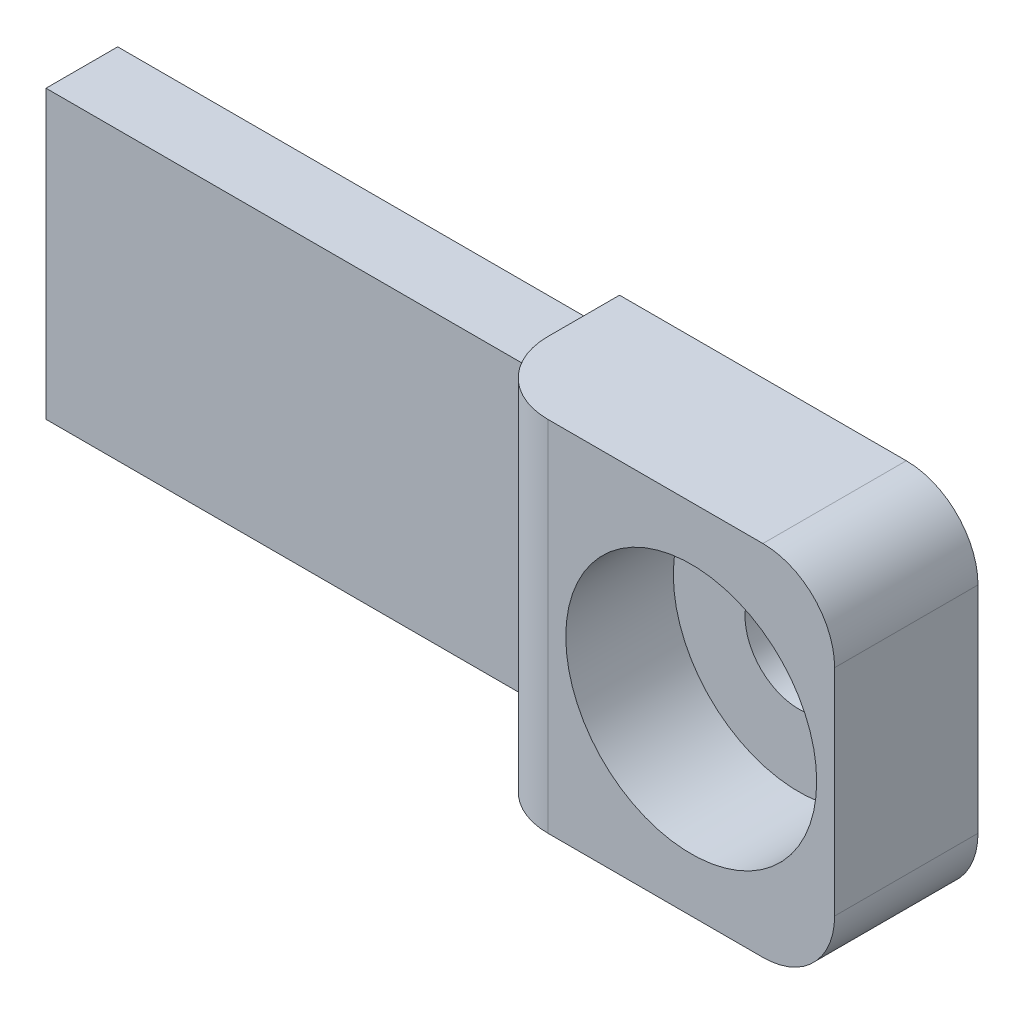
ISO-10303-21;
HEADER;
FILE_DESCRIPTION(('STEP AP214'),'2;1');
FILE_NAME('part.step','',(''),(''),'','','');
FILE_SCHEMA(('AUTOMOTIVE_DESIGN { 1 0 10303 214 1 1 1 1 }'));
ENDSEC;
DATA;
#1=APPLICATION_CONTEXT('core data for automotive mechanical design processes');
#2=APPLICATION_PROTOCOL_DEFINITION('international standard','automotive_design',2000,#1);
#3=PRODUCT_CONTEXT('',#1,'mechanical');
#4=PRODUCT('Part','Part','',(#3));
#5=PRODUCT_RELATED_PRODUCT_CATEGORY('part','',(#4));
#6=PRODUCT_DEFINITION_FORMATION('','',#4);
#7=PRODUCT_DEFINITION_CONTEXT('part definition',#1,'design');
#8=PRODUCT_DEFINITION('design','',#6,#7);
#9=PRODUCT_DEFINITION_SHAPE('','',#8);
#10=(LENGTH_UNIT() NAMED_UNIT(*) SI_UNIT(.MILLI.,.METRE.));
#11=(NAMED_UNIT(*) PLANE_ANGLE_UNIT() SI_UNIT($,.RADIAN.));
#12=(NAMED_UNIT(*) SI_UNIT($,.STERADIAN.) SOLID_ANGLE_UNIT());
#13=UNCERTAINTY_MEASURE_WITH_UNIT(LENGTH_MEASURE(1.E-05),#10,'distance_accuracy_value','');
#14=(GEOMETRIC_REPRESENTATION_CONTEXT(3) GLOBAL_UNCERTAINTY_ASSIGNED_CONTEXT((#13)) GLOBAL_UNIT_ASSIGNED_CONTEXT((#10,
#11,#12)) REPRESENTATION_CONTEXT('',''));
#15=CARTESIAN_POINT('',(0.,0.,0.));
#16=DIRECTION('',(0.,0.,1.));
#17=DIRECTION('',(1.,0.,0.));
#18=AXIS2_PLACEMENT_3D('',#15,#16,#17);
#19=CARTESIAN_POINT('',(0.,20.,20.));
#20=DIRECTION('',(1.,0.,0.));
#21=DIRECTION('',(0.,1.,0.));
#22=AXIS2_PLACEMENT_3D('',#19,#20,#21);
#23=PLANE('',#22);
#24=DIRECTION('',(0.,0.,-1.));
#25=VECTOR('',#24,1.);
#26=CARTESIAN_POINT('',(0.,-25.,20.));
#27=LINE('',#26,#25);
#28=CARTESIAN_POINT('',(0.,-25.,10.));
#29=VERTEX_POINT('',#28);
#30=CARTESIAN_POINT('',(0.,-25.,0.));
#31=VERTEX_POINT('',#30);
#32=EDGE_CURVE('E178',#29,#31,#27,.T.);
#33=ORIENTED_EDGE('',*,*,#32,.F.);
#34=DIRECTION('',(0.,-1.,0.));
#35=VECTOR('',#34,1.);
#36=CARTESIAN_POINT('',(0.,25.,10.));
#37=LINE('',#36,#35);
#38=CARTESIAN_POINT('',(0.,-20.,10.));
#39=VERTEX_POINT('',#38);
#40=EDGE_CURVE('E41',#29,#39,#37,.F.);
#41=ORIENTED_EDGE('',*,*,#40,.T.);
#42=DIRECTION('',(0.,0.,-1.));
#43=VECTOR('',#42,1.);
#44=CARTESIAN_POINT('',(0.,-20.,20.));
#45=LINE('',#44,#43);
#46=CARTESIAN_POINT('',(0.,-20.,0.));
#47=VERTEX_POINT('',#46);
#48=EDGE_CURVE('E176',#39,#47,#45,.T.);
#49=ORIENTED_EDGE('',*,*,#48,.T.);
#50=DIRECTION('',(0.,-1.,0.));
#51=VECTOR('',#50,1.);
#52=CARTESIAN_POINT('',(0.,-20.,0.));
#53=LINE('',#52,#51);
#54=EDGE_CURVE('E196',#47,#31,#53,.T.);
#55=ORIENTED_EDGE('',*,*,#54,.T.);
#56=EDGE_LOOP('',(#33,#41,#49,#55));
#57=FACE_BOUND('',#56,.T.);
#58=ADVANCED_FACE('F33',(#57),#23,.F.);
#59=CARTESIAN_POINT('',(30.,0.,-0.001000000000001));
#60=DIRECTION('',(0.,0.,1.));
#61=DIRECTION('',(1.,0.,0.));
#62=AXIS2_PLACEMENT_3D('',#59,#60,#61);
#63=CYLINDRICAL_SURFACE('',#62,7.5);
#64=CARTESIAN_POINT('',(30.,0.,0.));
#65=DIRECTION('',(0.,0.,1.));
#66=DIRECTION('',(1.,0.,0.));
#67=AXIS2_PLACEMENT_3D('',#64,#65,#66);
#68=CIRCLE('',#67,7.5);
#69=CARTESIAN_POINT('',(37.5,0.,0.));
#70=VERTEX_POINT('',#69);
#71=EDGE_CURVE('E173',#70,#70,#68,.F.);
#72=ORIENTED_EDGE('',*,*,#71,.T.);
#73=EDGE_LOOP('',(#72));
#74=FACE_BOUND('',#73,.T.);
#75=CARTESIAN_POINT('',(30.,0.,5.));
#76=DIRECTION('',(0.,0.,1.));
#77=DIRECTION('',(1.,0.,0.));
#78=AXIS2_PLACEMENT_3D('',#75,#76,#77);
#79=CIRCLE('',#78,7.5);
#80=CARTESIAN_POINT('',(37.5,0.,5.));
#81=VERTEX_POINT('',#80);
#82=EDGE_CURVE('E170',#81,#81,#79,.F.);
#83=ORIENTED_EDGE('',*,*,#82,.F.);
#84=EDGE_LOOP('',(#83));
#85=FACE_BOUND('',#84,.T.);
#86=ADVANCED_FACE('F262',(#74,#85),#63,.F.);
#87=CARTESIAN_POINT('',(-70.,20.,20.));
#88=DIRECTION('',(1.,0.,0.));
#89=DIRECTION('',(0.,1.,0.));
#90=AXIS2_PLACEMENT_3D('',#87,#88,#89);
#91=PLANE('',#90);
#92=DIRECTION('',(0.,0.,-1.));
#93=VECTOR('',#92,1.);
#94=CARTESIAN_POINT('',(-70.,-20.,20.));
#95=LINE('',#94,#93);
#96=CARTESIAN_POINT('',(-70.,-20.0000000000001,10.));
#97=VERTEX_POINT('',#96);
#98=CARTESIAN_POINT('',(-70.,-20.,0.));
#99=VERTEX_POINT('',#98);
#100=EDGE_CURVE('E169',#97,#99,#95,.T.);
#101=ORIENTED_EDGE('',*,*,#100,.F.);
#102=DIRECTION('',(0.,-1.,0.));
#103=VECTOR('',#102,1.);
#104=CARTESIAN_POINT('',(-70.,20.,10.));
#105=LINE('',#104,#103);
#106=CARTESIAN_POINT('',(-70.,20.,10.));
#107=VERTEX_POINT('',#106);
#108=EDGE_CURVE('E126',#107,#97,#105,.T.);
#109=ORIENTED_EDGE('',*,*,#108,.F.);
#110=DIRECTION('',(0.,0.,-1.));
#111=VECTOR('',#110,1.);
#112=CARTESIAN_POINT('',(-70.,20.,20.));
#113=LINE('',#112,#111);
#114=CARTESIAN_POINT('',(-70.,20.,0.));
#115=VERTEX_POINT('',#114);
#116=EDGE_CURVE('E134',#107,#115,#113,.T.);
#117=ORIENTED_EDGE('',*,*,#116,.T.);
#118=DIRECTION('',(0.,-1.,0.));
#119=VECTOR('',#118,1.);
#120=CARTESIAN_POINT('',(-70.,20.,0.));
#121=LINE('',#120,#119);
#122=EDGE_CURVE('E202',#115,#99,#121,.T.);
#123=ORIENTED_EDGE('',*,*,#122,.T.);
#124=EDGE_LOOP('',(#101,#109,#117,#123));
#125=FACE_BOUND('',#124,.T.);
#126=ADVANCED_FACE('F224',(#125),#91,.F.);
#127=CARTESIAN_POINT('',(-70.,-20.,20.));
#128=DIRECTION('',(0.,1.,0.));
#129=DIRECTION('',(-1.,0.,0.));
#130=AXIS2_PLACEMENT_3D('',#127,#128,#129);
#131=PLANE('',#130);
#132=ORIENTED_EDGE('',*,*,#48,.F.);
#133=DIRECTION('',(-1.,0.,0.));
#134=VECTOR('',#133,1.);
#135=CARTESIAN_POINT('',(0.,-20.,10.));
#136=LINE('',#135,#134);
#137=EDGE_CURVE('E122',#39,#97,#136,.T.);
#138=ORIENTED_EDGE('',*,*,#137,.T.);
#139=ORIENTED_EDGE('',*,*,#100,.T.);
#140=DIRECTION('',(1.,0.,0.));
#141=VECTOR('',#140,1.);
#142=CARTESIAN_POINT('',(-70.,-20.,0.));
#143=LINE('',#142,#141);
#144=EDGE_CURVE('E199',#99,#47,#143,.T.);
#145=ORIENTED_EDGE('',*,*,#144,.T.);
#146=EDGE_LOOP('',(#132,#138,#139,#145));
#147=FACE_BOUND('',#146,.T.);
#148=ADVANCED_FACE('F222',(#147),#131,.F.);
#149=CARTESIAN_POINT('',(0.,-25.,20.));
#150=DIRECTION('',(0.,1.,0.));
#151=DIRECTION('',(-1.,0.,0.));
#152=AXIS2_PLACEMENT_3D('',#149,#150,#151);
#153=PLANE('',#152);
#154=DIRECTION('',(1.,0.,0.));
#155=VECTOR('',#154,1.);
#156=CARTESIAN_POINT('',(0.,-25.,20.));
#157=LINE('',#156,#155);
#158=CARTESIAN_POINT('',(10.,-25.,20.));
#159=VERTEX_POINT('',#158);
#160=CARTESIAN_POINT('',(40.,-25.,20.));
#161=VERTEX_POINT('',#160);
#162=EDGE_CURVE('E185',#159,#161,#157,.T.);
#163=ORIENTED_EDGE('',*,*,#162,.F.);
#164=CARTESIAN_POINT('',(10.,-25.,10.));
#165=DIRECTION('',(0.,1.,0.));
#166=DIRECTION('',(-1.,0.,0.));
#167=AXIS2_PLACEMENT_3D('',#164,#165,#166);
#168=CIRCLE('',#167,10.);
#169=EDGE_CURVE('E56',#159,#29,#168,.F.);
#170=ORIENTED_EDGE('',*,*,#169,.T.);
#171=ORIENTED_EDGE('',*,*,#32,.T.);
#172=DIRECTION('',(1.,0.,0.));
#173=VECTOR('',#172,1.);
#174=CARTESIAN_POINT('',(0.,-25.,0.));
#175=LINE('',#174,#173);
#176=CARTESIAN_POINT('',(40.,-25.,0.));
#177=VERTEX_POINT('',#176);
#178=EDGE_CURVE('E193',#31,#177,#175,.T.);
#179=ORIENTED_EDGE('',*,*,#178,.T.);
#180=DIRECTION('',(0.,0.,-1.));
#181=VECTOR('',#180,1.);
#182=CARTESIAN_POINT('',(40.,-25.,20.));
#183=LINE('',#182,#181);
#184=EDGE_CURVE('E157',#177,#161,#183,.F.);
#185=ORIENTED_EDGE('',*,*,#184,.T.);
#186=EDGE_LOOP('',(#163,#170,#171,#179,#185));
#187=FACE_BOUND('',#186,.T.);
#188=ADVANCED_FACE('F236',(#187),#153,.F.);
#189=CARTESIAN_POINT('',(50.,25.,20.));
#190=DIRECTION('',(-1.,0.,0.));
#191=DIRECTION('',(0.,-1.,0.));
#192=AXIS2_PLACEMENT_3D('',#189,#190,#191);
#193=PLANE('',#192);
#194=DIRECTION('',(0.,1.,0.));
#195=VECTOR('',#194,1.);
#196=CARTESIAN_POINT('',(50.,25.,20.));
#197=LINE('',#196,#195);
#198=CARTESIAN_POINT('',(50.,-15.,20.));
#199=VERTEX_POINT('',#198);
#200=CARTESIAN_POINT('',(50.,15.,20.));
#201=VERTEX_POINT('',#200);
#202=EDGE_CURVE('E207',#199,#201,#197,.T.);
#203=ORIENTED_EDGE('',*,*,#202,.F.);
#204=DIRECTION('',(0.,0.,-1.));
#205=VECTOR('',#204,1.);
#206=CARTESIAN_POINT('',(50.,-15.,20.));
#207=LINE('',#206,#205);
#208=CARTESIAN_POINT('',(50.,-15.,0.));
#209=VERTEX_POINT('',#208);
#210=EDGE_CURVE('E164',#199,#209,#207,.T.);
#211=ORIENTED_EDGE('',*,*,#210,.T.);
#212=DIRECTION('',(0.,1.,0.));
#213=VECTOR('',#212,1.);
#214=CARTESIAN_POINT('',(50.,25.,0.));
#215=LINE('',#214,#213);
#216=CARTESIAN_POINT('',(50.,15.,0.));
#217=VERTEX_POINT('',#216);
#218=EDGE_CURVE('E190',#209,#217,#215,.T.);
#219=ORIENTED_EDGE('',*,*,#218,.T.);
#220=DIRECTION('',(0.,0.,-1.));
#221=VECTOR('',#220,1.);
#222=CARTESIAN_POINT('',(50.,15.,20.));
#223=LINE('',#222,#221);
#224=EDGE_CURVE('E167',#217,#201,#223,.F.);
#225=ORIENTED_EDGE('',*,*,#224,.T.);
#226=EDGE_LOOP('',(#203,#211,#219,#225));
#227=FACE_BOUND('',#226,.T.);
#228=ADVANCED_FACE('F245',(#227),#193,.F.);
#229=CARTESIAN_POINT('',(0.,25.,20.));
#230=DIRECTION('',(0.,-1.,0.));
#231=DIRECTION('',(1.,0.,0.));
#232=AXIS2_PLACEMENT_3D('',#229,#230,#231);
#233=PLANE('',#232);
#234=DIRECTION('',(0.,0.,-1.));
#235=VECTOR('',#234,1.);
#236=CARTESIAN_POINT('',(0.,25.,20.));
#237=LINE('',#236,#235);
#238=CARTESIAN_POINT('',(0.,25.,10.));
#239=VERTEX_POINT('',#238);
#240=CARTESIAN_POINT('',(0.,25.,0.));
#241=VERTEX_POINT('',#240);
#242=EDGE_CURVE('E140',#239,#241,#237,.T.);
#243=ORIENTED_EDGE('',*,*,#242,.F.);
#244=CARTESIAN_POINT('',(10.,25.,10.));
#245=DIRECTION('',(0.,-1.,0.));
#246=DIRECTION('',(1.,0.,0.));
#247=AXIS2_PLACEMENT_3D('',#244,#245,#246);
#248=CIRCLE('',#247,10.);
#249=CARTESIAN_POINT('',(10.,25.,20.));
#250=VERTEX_POINT('',#249);
#251=EDGE_CURVE('E11',#239,#250,#248,.F.);
#252=ORIENTED_EDGE('',*,*,#251,.T.);
#253=DIRECTION('',(-1.,0.,0.));
#254=VECTOR('',#253,1.);
#255=CARTESIAN_POINT('',(0.,25.,20.));
#256=LINE('',#255,#254);
#257=CARTESIAN_POINT('',(40.,25.,20.));
#258=VERTEX_POINT('',#257);
#259=EDGE_CURVE('E182',#258,#250,#256,.T.);
#260=ORIENTED_EDGE('',*,*,#259,.F.);
#261=DIRECTION('',(0.,0.,-1.));
#262=VECTOR('',#261,1.);
#263=CARTESIAN_POINT('',(40.,25.,20.));
#264=LINE('',#263,#262);
#265=CARTESIAN_POINT('',(40.,25.,0.));
#266=VERTEX_POINT('',#265);
#267=EDGE_CURVE('E150',#258,#266,#264,.T.);
#268=ORIENTED_EDGE('',*,*,#267,.T.);
#269=DIRECTION('',(-1.,0.,0.));
#270=VECTOR('',#269,1.);
#271=CARTESIAN_POINT('',(0.,25.,0.));
#272=LINE('',#271,#270);
#273=EDGE_CURVE('E187',#266,#241,#272,.T.);
#274=ORIENTED_EDGE('',*,*,#273,.T.);
#275=EDGE_LOOP('',(#243,#252,#260,#268,#274));
#276=FACE_BOUND('',#275,.T.);
#277=ADVANCED_FACE('F251',(#276),#233,.F.);
#278=DIRECTION('',(0.,0.,-1.));
#279=VECTOR('',#278,1.);
#280=CARTESIAN_POINT('',(0.,20.,20.));
#281=LINE('',#280,#279);
#282=CARTESIAN_POINT('',(0.,20.0000000000001,10.));
#283=VERTEX_POINT('',#282);
#284=CARTESIAN_POINT('',(0.,20.,0.));
#285=VERTEX_POINT('',#284);
#286=EDGE_CURVE('E132',#283,#285,#281,.T.);
#287=ORIENTED_EDGE('',*,*,#286,.F.);
#288=DIRECTION('',(0.,-1.,0.));
#289=VECTOR('',#288,1.);
#290=CARTESIAN_POINT('',(0.,25.,10.));
#291=LINE('',#290,#289);
#292=EDGE_CURVE('E48',#283,#239,#291,.F.);
#293=ORIENTED_EDGE('',*,*,#292,.T.);
#294=ORIENTED_EDGE('',*,*,#242,.T.);
#295=DIRECTION('',(0.,-1.,0.));
#296=VECTOR('',#295,1.);
#297=CARTESIAN_POINT('',(0.,20.,0.));
#298=LINE('',#297,#296);
#299=EDGE_CURVE('E138',#241,#285,#298,.T.);
#300=ORIENTED_EDGE('',*,*,#299,.T.);
#301=EDGE_LOOP('',(#287,#293,#294,#300));
#302=FACE_BOUND('',#301,.T.);
#303=ADVANCED_FACE('F136',(#302),#23,.F.);
#304=CARTESIAN_POINT('',(-70.,20.,20.));
#305=DIRECTION('',(0.,-1.,0.));
#306=DIRECTION('',(1.,0.,0.));
#307=AXIS2_PLACEMENT_3D('',#304,#305,#306);
#308=PLANE('',#307);
#309=ORIENTED_EDGE('',*,*,#116,.F.);
#310=DIRECTION('',(-1.,0.,0.));
#311=VECTOR('',#310,1.);
#312=CARTESIAN_POINT('',(0.,20.0000000000001,10.));
#313=LINE('',#312,#311);
#314=EDGE_CURVE('E119',#283,#107,#313,.T.);
#315=ORIENTED_EDGE('',*,*,#314,.F.);
#316=ORIENTED_EDGE('',*,*,#286,.T.);
#317=DIRECTION('',(-1.,0.,0.));
#318=VECTOR('',#317,1.);
#319=CARTESIAN_POINT('',(-70.,20.,0.));
#320=LINE('',#319,#318);
#321=EDGE_CURVE('E183',#285,#115,#320,.T.);
#322=ORIENTED_EDGE('',*,*,#321,.T.);
#323=EDGE_LOOP('',(#309,#315,#316,#322));
#324=FACE_BOUND('',#323,.T.);
#325=ADVANCED_FACE('F130',(#324),#308,.F.);
#326=CARTESIAN_POINT('',(0.,0.,20.));
#327=DIRECTION('',(0.,0.,1.));
#328=DIRECTION('',(1.,0.,0.));
#329=AXIS2_PLACEMENT_3D('',#326,#327,#328);
#330=PLANE('',#329);
#331=ORIENTED_EDGE('',*,*,#259,.T.);
#332=DIRECTION('',(0.,-1.,0.));
#333=VECTOR('',#332,1.);
#334=CARTESIAN_POINT('',(10.,-25.,20.));
#335=LINE('',#334,#333);
#336=EDGE_CURVE('E145',#250,#159,#335,.T.);
#337=ORIENTED_EDGE('',*,*,#336,.T.);
#338=ORIENTED_EDGE('',*,*,#162,.T.);
#339=CARTESIAN_POINT('',(40.,-15.,20.));
#340=DIRECTION('',(0.,0.,1.));
#341=DIRECTION('',(1.,0.,0.));
#342=AXIS2_PLACEMENT_3D('',#339,#340,#341);
#343=CIRCLE('',#342,10.);
#344=EDGE_CURVE('E153',#161,#199,#343,.T.);
#345=ORIENTED_EDGE('',*,*,#344,.T.);
#346=ORIENTED_EDGE('',*,*,#202,.T.);
#347=CARTESIAN_POINT('',(40.,15.,20.));
#348=DIRECTION('',(0.,0.,1.));
#349=DIRECTION('',(1.,0.,0.));
#350=AXIS2_PLACEMENT_3D('',#347,#348,#349);
#351=CIRCLE('',#350,10.);
#352=EDGE_CURVE('E155',#201,#258,#351,.T.);
#353=ORIENTED_EDGE('',*,*,#352,.T.);
#354=EDGE_LOOP('',(#331,#337,#338,#345,#346,#353));
#355=FACE_BOUND('',#354,.T.);
#356=CARTESIAN_POINT('',(30.,0.,20.));
#357=DIRECTION('',(0.,0.,1.));
#358=DIRECTION('',(1.,0.,0.));
#359=AXIS2_PLACEMENT_3D('',#356,#357,#358);
#360=CIRCLE('',#359,17.5);
#361=CARTESIAN_POINT('',(47.5,0.,20.));
#362=VERTEX_POINT('',#361);
#363=EDGE_CURVE('E213',#362,#362,#360,.T.);
#364=ORIENTED_EDGE('',*,*,#363,.F.);
#365=EDGE_LOOP('',(#364));
#366=FACE_BOUND('',#365,.T.);
#367=ADVANCED_FACE('F233',(#355,#366),#330,.T.);
#368=CARTESIAN_POINT('',(0.,0.,0.));
#369=DIRECTION('',(0.,0.,1.));
#370=DIRECTION('',(1.,0.,0.));
#371=AXIS2_PLACEMENT_3D('',#368,#369,#370);
#372=PLANE('',#371);
#373=ORIENTED_EDGE('',*,*,#71,.F.);
#374=EDGE_LOOP('',(#373));
#375=FACE_BOUND('',#374,.T.);
#376=ORIENTED_EDGE('',*,*,#218,.F.);
#377=CARTESIAN_POINT('',(40.,-15.,0.));
#378=DIRECTION('',(0.,0.,1.));
#379=DIRECTION('',(1.,0.,0.));
#380=AXIS2_PLACEMENT_3D('',#377,#378,#379);
#381=CIRCLE('',#380,10.);
#382=EDGE_CURVE('E160',#209,#177,#381,.F.);
#383=ORIENTED_EDGE('',*,*,#382,.T.);
#384=ORIENTED_EDGE('',*,*,#178,.F.);
#385=ORIENTED_EDGE('',*,*,#54,.F.);
#386=ORIENTED_EDGE('',*,*,#144,.F.);
#387=ORIENTED_EDGE('',*,*,#122,.F.);
#388=ORIENTED_EDGE('',*,*,#321,.F.);
#389=ORIENTED_EDGE('',*,*,#299,.F.);
#390=ORIENTED_EDGE('',*,*,#273,.F.);
#391=CARTESIAN_POINT('',(40.,15.,0.));
#392=DIRECTION('',(0.,0.,1.));
#393=DIRECTION('',(1.,0.,0.));
#394=AXIS2_PLACEMENT_3D('',#391,#392,#393);
#395=CIRCLE('',#394,10.);
#396=EDGE_CURVE('E162',#266,#217,#395,.F.);
#397=ORIENTED_EDGE('',*,*,#396,.T.);
#398=EDGE_LOOP('',(#376,#383,#384,#385,#386,#387,#388,#389,#390,#397));
#399=FACE_BOUND('',#398,.T.);
#400=ADVANCED_FACE('F228',(#375,#399),#372,.F.);
#401=CARTESIAN_POINT('',(30.,0.,5.));
#402=DIRECTION('',(0.,0.,1.));
#403=DIRECTION('',(1.,0.,0.));
#404=AXIS2_PLACEMENT_3D('',#401,#402,#403);
#405=PLANE('',#404);
#406=CARTESIAN_POINT('',(30.,0.,5.));
#407=DIRECTION('',(0.,0.,1.));
#408=DIRECTION('',(1.,0.,0.));
#409=AXIS2_PLACEMENT_3D('',#406,#407,#408);
#410=CIRCLE('',#409,17.5);
#411=CARTESIAN_POINT('',(47.5,0.,5.));
#412=VERTEX_POINT('',#411);
#413=EDGE_CURVE('E174',#412,#412,#410,.T.);
#414=ORIENTED_EDGE('',*,*,#413,.T.);
#415=EDGE_LOOP('',(#414));
#416=FACE_BOUND('',#415,.T.);
#417=ORIENTED_EDGE('',*,*,#82,.T.);
#418=EDGE_LOOP('',(#417));
#419=FACE_BOUND('',#418,.T.);
#420=ADVANCED_FACE('F273',(#416,#419),#405,.T.);
#421=CARTESIAN_POINT('',(30.,0.,5.));
#422=DIRECTION('',(0.,0.,1.));
#423=DIRECTION('',(1.,0.,0.));
#424=AXIS2_PLACEMENT_3D('',#421,#422,#423);
#425=CYLINDRICAL_SURFACE('',#424,17.5);
#426=ORIENTED_EDGE('',*,*,#413,.F.);
#427=EDGE_LOOP('',(#426));
#428=FACE_BOUND('',#427,.T.);
#429=ORIENTED_EDGE('',*,*,#363,.T.);
#430=EDGE_LOOP('',(#429));
#431=FACE_BOUND('',#430,.T.);
#432=ADVANCED_FACE('F277',(#428,#431),#425,.F.);
#433=CARTESIAN_POINT('',(0.,20.0000000000001,10.));
#434=DIRECTION('',(0.,0.,-1.));
#435=DIRECTION('',(0.,1.,0.));
#436=AXIS2_PLACEMENT_3D('',#433,#434,#435);
#437=PLANE('',#436);
#438=ORIENTED_EDGE('',*,*,#108,.T.);
#439=ORIENTED_EDGE('',*,*,#137,.F.);
#440=DIRECTION('',(0.,-1.,0.));
#441=VECTOR('',#440,1.);
#442=CARTESIAN_POINT('',(0.,20.0000000000001,10.));
#443=LINE('',#442,#441);
#444=EDGE_CURVE('E116',#283,#39,#443,.T.);
#445=ORIENTED_EDGE('',*,*,#444,.F.);
#446=ORIENTED_EDGE('',*,*,#314,.T.);
#447=EDGE_LOOP('',(#438,#439,#445,#446));
#448=FACE_BOUND('',#447,.T.);
#449=ADVANCED_FACE('F118',(#448),#437,.F.);
#450=CARTESIAN_POINT('',(40.,-15.,20.));
#451=DIRECTION('',(0.,0.,-1.));
#452=DIRECTION('',(-1.,0.,0.));
#453=AXIS2_PLACEMENT_3D('',#450,#451,#452);
#454=CYLINDRICAL_SURFACE('',#453,10.);
#455=ORIENTED_EDGE('',*,*,#344,.F.);
#456=ORIENTED_EDGE('',*,*,#184,.F.);
#457=ORIENTED_EDGE('',*,*,#382,.F.);
#458=ORIENTED_EDGE('',*,*,#210,.F.);
#459=EDGE_LOOP('',(#455,#456,#457,#458));
#460=FACE_BOUND('',#459,.T.);
#461=ADVANCED_FACE('F241',(#460),#454,.T.);
#462=CARTESIAN_POINT('',(40.,15.,20.));
#463=DIRECTION('',(0.,0.,-1.));
#464=DIRECTION('',(-1.,0.,0.));
#465=AXIS2_PLACEMENT_3D('',#462,#463,#464);
#466=CYLINDRICAL_SURFACE('',#465,10.);
#467=ORIENTED_EDGE('',*,*,#352,.F.);
#468=ORIENTED_EDGE('',*,*,#224,.F.);
#469=ORIENTED_EDGE('',*,*,#396,.F.);
#470=ORIENTED_EDGE('',*,*,#267,.F.);
#471=EDGE_LOOP('',(#467,#468,#469,#470));
#472=FACE_BOUND('',#471,.T.);
#473=ADVANCED_FACE('F248',(#472),#466,.T.);
#474=CARTESIAN_POINT('',(10.,0.,10.));
#475=DIRECTION('',(0.,1.,0.));
#476=DIRECTION('',(-1.,0.,0.));
#477=AXIS2_PLACEMENT_3D('',#474,#475,#476);
#478=CYLINDRICAL_SURFACE('',#477,10.);
#479=ORIENTED_EDGE('',*,*,#444,.T.);
#480=ORIENTED_EDGE('',*,*,#40,.F.);
#481=ORIENTED_EDGE('',*,*,#169,.F.);
#482=ORIENTED_EDGE('',*,*,#336,.F.);
#483=ORIENTED_EDGE('',*,*,#251,.F.);
#484=ORIENTED_EDGE('',*,*,#292,.F.);
#485=EDGE_LOOP('',(#479,#480,#481,#482,#483,#484));
#486=FACE_BOUND('',#485,.T.);
#487=ADVANCED_FACE('F35',(#486),#478,.T.);
#488=CLOSED_SHELL('',(#58,#86,#126,#148,#188,#228,#277,#303,#325,#367,#400,#420,#432,#449,#461,
#473,#487));
#489=MANIFOLD_SOLID_BREP('B2',#488);
#490=ADVANCED_BREP_SHAPE_REPRESENTATION('',(#18,#489),#14);
#491=SHAPE_DEFINITION_REPRESENTATION(#9,#490);
ENDSEC;
END-ISO-10303-21;
